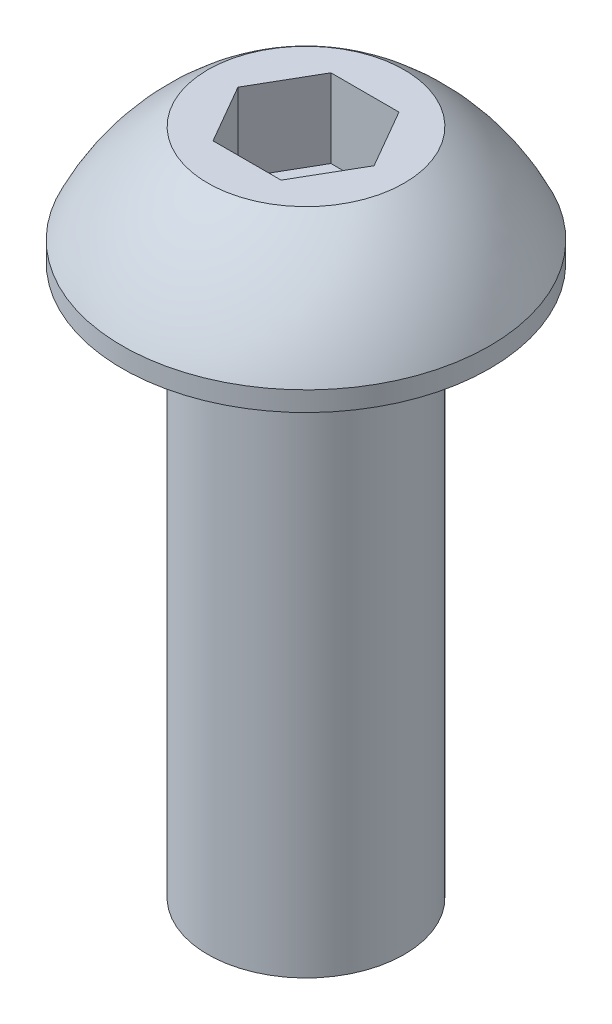
ISO-10303-21;
HEADER;
FILE_DESCRIPTION(('STEP AP214'),'2;1');
FILE_NAME('part.step','',(''),(''),'','','');
FILE_SCHEMA(('AUTOMOTIVE_DESIGN { 1 0 10303 214 1 1 1 1 }'));
ENDSEC;
DATA;
#1=APPLICATION_CONTEXT('core data for automotive mechanical design processes');
#2=APPLICATION_PROTOCOL_DEFINITION('international standard','automotive_design',2000,#1);
#3=PRODUCT_CONTEXT('',#1,'mechanical');
#4=PRODUCT('Part','Part','',(#3));
#5=PRODUCT_RELATED_PRODUCT_CATEGORY('part','',(#4));
#6=PRODUCT_DEFINITION_FORMATION('','',#4);
#7=PRODUCT_DEFINITION_CONTEXT('part definition',#1,'design');
#8=PRODUCT_DEFINITION('design','',#6,#7);
#9=PRODUCT_DEFINITION_SHAPE('','',#8);
#10=(LENGTH_UNIT() NAMED_UNIT(*) SI_UNIT(.MILLI.,.METRE.));
#11=(NAMED_UNIT(*) PLANE_ANGLE_UNIT() SI_UNIT($,.RADIAN.));
#12=(NAMED_UNIT(*) SI_UNIT($,.STERADIAN.) SOLID_ANGLE_UNIT());
#13=UNCERTAINTY_MEASURE_WITH_UNIT(LENGTH_MEASURE(1.E-05),#10,'distance_accuracy_value','');
#14=(GEOMETRIC_REPRESENTATION_CONTEXT(3) GLOBAL_UNCERTAINTY_ASSIGNED_CONTEXT((#13)) GLOBAL_UNIT_ASSIGNED_CONTEXT((#10,
#11,#12)) REPRESENTATION_CONTEXT('',''));
#15=CARTESIAN_POINT('',(0.,0.,0.));
#16=DIRECTION('',(0.,0.,1.));
#17=DIRECTION('',(1.,0.,0.));
#18=AXIS2_PLACEMENT_3D('',#15,#16,#17);
#19=CARTESIAN_POINT('',(0.,-14.,0.));
#20=DIRECTION('',(0.,-1.,0.));
#21=DIRECTION('',(1.,0.,0.));
#22=AXIS2_PLACEMENT_3D('',#19,#20,#21);
#23=CYLINDRICAL_SURFACE('',#22,2.5);
#24=CARTESIAN_POINT('',(0.,0.,0.));
#25=DIRECTION('',(0.,-1.,0.));
#26=DIRECTION('',(1.,0.,0.));
#27=AXIS2_PLACEMENT_3D('',#24,#25,#26);
#28=CIRCLE('',#27,2.5);
#29=CARTESIAN_POINT('',(2.5,0.,0.));
#30=VERTEX_POINT('',#29);
#31=EDGE_CURVE('E11',#30,#30,#28,.T.);
#32=ORIENTED_EDGE('',*,*,#31,.T.);
#33=EDGE_LOOP('',(#32));
#34=FACE_BOUND('',#33,.T.);
#35=CARTESIAN_POINT('',(0.,-14.,0.));
#36=DIRECTION('',(0.,-1.,0.));
#37=DIRECTION('',(1.,0.,0.));
#38=AXIS2_PLACEMENT_3D('',#35,#36,#37);
#39=CIRCLE('',#38,2.5);
#40=CARTESIAN_POINT('',(2.5,-14.,0.));
#41=VERTEX_POINT('',#40);
#42=EDGE_CURVE('E168',#41,#41,#39,.T.);
#43=ORIENTED_EDGE('',*,*,#42,.F.);
#44=EDGE_LOOP('',(#43));
#45=FACE_BOUND('',#44,.T.);
#46=ADVANCED_FACE('F41',(#34,#45),#23,.T.);
#47=CARTESIAN_POINT('',(2.5,0.,0.));
#48=DIRECTION('',(0.,-1.,0.));
#49=DIRECTION('',(1.,0.,0.));
#50=AXIS2_PLACEMENT_3D('',#47,#48,#49);
#51=PLANE('',#50);
#52=CARTESIAN_POINT('',(0.,0.,0.));
#53=DIRECTION('',(0.,-1.,0.));
#54=DIRECTION('',(1.,0.,0.));
#55=AXIS2_PLACEMENT_3D('',#52,#53,#54);
#56=CIRCLE('',#55,4.675);
#57=CARTESIAN_POINT('',(4.675,0.,0.));
#58=VERTEX_POINT('',#57);
#59=EDGE_CURVE('E49',#58,#58,#56,.T.);
#60=ORIENTED_EDGE('',*,*,#59,.T.);
#61=EDGE_LOOP('',(#60));
#62=FACE_BOUND('',#61,.T.);
#63=ORIENTED_EDGE('',*,*,#31,.F.);
#64=EDGE_LOOP('',(#63));
#65=FACE_BOUND('',#64,.T.);
#66=ADVANCED_FACE('F190',(#62,#65),#51,.T.);
#67=CARTESIAN_POINT('',(0.,-14.,0.));
#68=DIRECTION('',(0.,-1.,0.));
#69=DIRECTION('',(1.,0.,0.));
#70=AXIS2_PLACEMENT_3D('',#67,#68,#69);
#71=CYLINDRICAL_SURFACE('',#70,4.675);
#72=CARTESIAN_POINT('',(0.,0.5,0.));
#73=DIRECTION('',(0.,-1.,0.));
#74=DIRECTION('',(1.,0.,0.));
#75=AXIS2_PLACEMENT_3D('',#72,#73,#74);
#76=CIRCLE('',#75,4.675);
#77=CARTESIAN_POINT('',(4.675,0.5,0.));
#78=VERTEX_POINT('',#77);
#79=EDGE_CURVE('E183',#78,#78,#76,.T.);
#80=ORIENTED_EDGE('',*,*,#79,.T.);
#81=EDGE_LOOP('',(#80));
#82=FACE_BOUND('',#81,.T.);
#83=ORIENTED_EDGE('',*,*,#59,.F.);
#84=EDGE_LOOP('',(#83));
#85=FACE_BOUND('',#84,.T.);
#86=ADVANCED_FACE('F193',(#82,#85),#71,.T.);
#87=CARTESIAN_POINT('',(0.,-2.03506364975577,0.));
#88=DIRECTION('',(0.,-1.,0.));
#89=DIRECTION('',(1.,0.,0.));
#90=AXIS2_PLACEMENT_3D('',#87,#88,#89);
#91=DEGENERATE_TOROIDAL_SURFACE('',#90,0.763147873282498,6.,.F.);
#92=CARTESIAN_POINT('',(0.,3.,0.));
#93=DIRECTION('',(0.,-1.,0.));
#94=DIRECTION('',(1.,0.,0.));
#95=AXIS2_PLACEMENT_3D('',#92,#93,#94);
#96=CIRCLE('',#95,2.5);
#97=CARTESIAN_POINT('',(2.5,3.,0.));
#98=VERTEX_POINT('',#97);
#99=EDGE_CURVE('E179',#98,#98,#96,.T.);
#100=ORIENTED_EDGE('',*,*,#99,.T.);
#101=EDGE_LOOP('',(#100));
#102=FACE_BOUND('',#101,.T.);
#103=ORIENTED_EDGE('',*,*,#79,.F.);
#104=EDGE_LOOP('',(#103));
#105=FACE_BOUND('',#104,.T.);
#106=ADVANCED_FACE('F195',(#102,#105),#91,.F.);
#107=CARTESIAN_POINT('',(2.5,3.,0.));
#108=DIRECTION('',(0.,1.,0.));
#109=DIRECTION('',(-1.,0.,0.));
#110=AXIS2_PLACEMENT_3D('',#107,#108,#109);
#111=PLANE('',#110);
#112=DIRECTION('',(-0.5,0.,-0.866025403784439));
#113=VECTOR('',#112,1.);
#114=CARTESIAN_POINT('',(1.73205080756888,3.,0.));
#115=LINE('',#114,#113);
#116=CARTESIAN_POINT('',(1.73205080756888,3.,0.));
#117=VERTEX_POINT('',#116);
#118=CARTESIAN_POINT('',(0.866025403784438,3.,-1.5));
#119=VERTEX_POINT('',#118);
#120=EDGE_CURVE('E58',#117,#119,#115,.T.);
#121=ORIENTED_EDGE('',*,*,#120,.F.);
#122=DIRECTION('',(0.5,0.,-0.866025403784439));
#123=VECTOR('',#122,1.);
#124=CARTESIAN_POINT('',(0.866025403784439,3.,1.5));
#125=LINE('',#124,#123);
#126=CARTESIAN_POINT('',(0.866025403784439,3.,1.5));
#127=VERTEX_POINT('',#126);
#128=EDGE_CURVE('E162',#127,#117,#125,.T.);
#129=ORIENTED_EDGE('',*,*,#128,.F.);
#130=DIRECTION('',(1.,0.,0.));
#131=VECTOR('',#130,1.);
#132=CARTESIAN_POINT('',(-0.866025403784437,3.,1.5));
#133=LINE('',#132,#131);
#134=CARTESIAN_POINT('',(-0.866025403784437,3.,1.5));
#135=VERTEX_POINT('',#134);
#136=EDGE_CURVE('E159',#135,#127,#133,.T.);
#137=ORIENTED_EDGE('',*,*,#136,.F.);
#138=DIRECTION('',(0.5,0.,0.866025403784438));
#139=VECTOR('',#138,1.);
#140=CARTESIAN_POINT('',(-1.73205080756888,3.,0.));
#141=LINE('',#140,#139);
#142=CARTESIAN_POINT('',(-1.73205080756888,3.,0.));
#143=VERTEX_POINT('',#142);
#144=EDGE_CURVE('E116',#143,#135,#141,.T.);
#145=ORIENTED_EDGE('',*,*,#144,.F.);
#146=DIRECTION('',(-0.5,0.,0.866025403784439));
#147=VECTOR('',#146,1.);
#148=CARTESIAN_POINT('',(-0.866025403784438,3.,-1.5));
#149=LINE('',#148,#147);
#150=CARTESIAN_POINT('',(-0.866025403784438,3.,-1.5));
#151=VERTEX_POINT('',#150);
#152=EDGE_CURVE('E153',#151,#143,#149,.T.);
#153=ORIENTED_EDGE('',*,*,#152,.F.);
#154=DIRECTION('',(-1.,0.,0.));
#155=VECTOR('',#154,1.);
#156=CARTESIAN_POINT('',(0.866025403784438,3.,-1.5));
#157=LINE('',#156,#155);
#158=EDGE_CURVE('E149',#119,#151,#157,.T.);
#159=ORIENTED_EDGE('',*,*,#158,.F.);
#160=EDGE_LOOP('',(#121,#129,#137,#145,#153,#159));
#161=FACE_BOUND('',#160,.T.);
#162=ORIENTED_EDGE('',*,*,#99,.F.);
#163=EDGE_LOOP('',(#162));
#164=FACE_BOUND('',#163,.T.);
#165=ADVANCED_FACE('F202',(#161,#164),#111,.T.);
#166=CARTESIAN_POINT('',(2.5,-14.,0.));
#167=DIRECTION('',(0.,-1.,0.));
#168=DIRECTION('',(1.,0.,0.));
#169=AXIS2_PLACEMENT_3D('',#166,#167,#168);
#170=PLANE('',#169);
#171=ORIENTED_EDGE('',*,*,#42,.T.);
#172=EDGE_LOOP('',(#171));
#173=FACE_BOUND('',#172,.T.);
#174=ADVANCED_FACE('F213',(#173),#170,.T.);
#175=CARTESIAN_POINT('',(1.73205080756888,0.999999999999999,0.));
#176=DIRECTION('',(0.866025403784439,0.,-0.5));
#177=DIRECTION('',(-0.5,0.,-0.866025403784439));
#178=AXIS2_PLACEMENT_3D('',#175,#176,#177);
#179=PLANE('',#178);
#180=ORIENTED_EDGE('',*,*,#120,.T.);
#181=DIRECTION('',(0.,1.,0.));
#182=VECTOR('',#181,1.);
#183=CARTESIAN_POINT('',(0.866025403784438,0.999999999999999,-1.5));
#184=LINE('',#183,#182);
#185=CARTESIAN_POINT('',(0.866025403784438,0.999999999999999,-1.5));
#186=VERTEX_POINT('',#185);
#187=EDGE_CURVE('E95',#186,#119,#184,.T.);
#188=ORIENTED_EDGE('',*,*,#187,.F.);
#189=DIRECTION('',(-0.5,0.,-0.866025403784439));
#190=VECTOR('',#189,1.);
#191=CARTESIAN_POINT('',(1.73205080756888,0.999999999999999,0.));
#192=LINE('',#191,#190);
#193=CARTESIAN_POINT('',(1.73205080756888,0.999999999999999,0.));
#194=VERTEX_POINT('',#193);
#195=EDGE_CURVE('E165',#194,#186,#192,.T.);
#196=ORIENTED_EDGE('',*,*,#195,.F.);
#197=DIRECTION('',(0.,1.,0.));
#198=VECTOR('',#197,1.);
#199=CARTESIAN_POINT('',(1.73205080756888,0.999999999999999,0.));
#200=LINE('',#199,#198);
#201=EDGE_CURVE('E69',#194,#117,#200,.T.);
#202=ORIENTED_EDGE('',*,*,#201,.T.);
#203=EDGE_LOOP('',(#180,#188,#196,#202));
#204=FACE_BOUND('',#203,.T.);
#205=ADVANCED_FACE('F215',(#204),#179,.F.);
#206=CARTESIAN_POINT('',(0.866025403784439,0.999999999999999,1.5));
#207=DIRECTION('',(0.866025403784439,0.,0.5));
#208=DIRECTION('',(0.5,0.,-0.866025403784439));
#209=AXIS2_PLACEMENT_3D('',#206,#207,#208);
#210=PLANE('',#209);
#211=ORIENTED_EDGE('',*,*,#128,.T.);
#212=ORIENTED_EDGE('',*,*,#201,.F.);
#213=DIRECTION('',(0.5,0.,-0.866025403784439));
#214=VECTOR('',#213,1.);
#215=CARTESIAN_POINT('',(0.866025403784439,0.999999999999999,1.5));
#216=LINE('',#215,#214);
#217=CARTESIAN_POINT('',(0.866025403784439,0.999999999999999,1.5));
#218=VERTEX_POINT('',#217);
#219=EDGE_CURVE('E130',#218,#194,#216,.T.);
#220=ORIENTED_EDGE('',*,*,#219,.F.);
#221=DIRECTION('',(0.,1.,0.));
#222=VECTOR('',#221,1.);
#223=CARTESIAN_POINT('',(0.866025403784439,0.999999999999999,1.5));
#224=LINE('',#223,#222);
#225=EDGE_CURVE('E121',#218,#127,#224,.T.);
#226=ORIENTED_EDGE('',*,*,#225,.T.);
#227=EDGE_LOOP('',(#211,#212,#220,#226));
#228=FACE_BOUND('',#227,.T.);
#229=ADVANCED_FACE('F221',(#228),#210,.F.);
#230=CARTESIAN_POINT('',(-0.866025403784437,0.999999999999999,1.5));
#231=DIRECTION('',(0.,0.,1.));
#232=DIRECTION('',(1.,0.,0.));
#233=AXIS2_PLACEMENT_3D('',#230,#231,#232);
#234=PLANE('',#233);
#235=ORIENTED_EDGE('',*,*,#136,.T.);
#236=ORIENTED_EDGE('',*,*,#225,.F.);
#237=DIRECTION('',(1.,0.,0.));
#238=VECTOR('',#237,1.);
#239=CARTESIAN_POINT('',(-0.866025403784437,0.999999999999999,1.5));
#240=LINE('',#239,#238);
#241=CARTESIAN_POINT('',(-0.866025403784437,0.999999999999999,1.5));
#242=VERTEX_POINT('',#241);
#243=EDGE_CURVE('E125',#242,#218,#240,.T.);
#244=ORIENTED_EDGE('',*,*,#243,.F.);
#245=DIRECTION('',(0.,1.,0.));
#246=VECTOR('',#245,1.);
#247=CARTESIAN_POINT('',(-0.866025403784437,0.999999999999999,1.5));
#248=LINE('',#247,#246);
#249=EDGE_CURVE('E109',#242,#135,#248,.T.);
#250=ORIENTED_EDGE('',*,*,#249,.T.);
#251=EDGE_LOOP('',(#235,#236,#244,#250));
#252=FACE_BOUND('',#251,.T.);
#253=ADVANCED_FACE('F126',(#252),#234,.F.);
#254=CARTESIAN_POINT('',(-1.73205080756888,0.999999999999999,0.));
#255=DIRECTION('',(-0.866025403784438,0.,0.5));
#256=DIRECTION('',(0.5,0.,0.866025403784438));
#257=AXIS2_PLACEMENT_3D('',#254,#255,#256);
#258=PLANE('',#257);
#259=ORIENTED_EDGE('',*,*,#144,.T.);
#260=ORIENTED_EDGE('',*,*,#249,.F.);
#261=DIRECTION('',(0.5,0.,0.866025403784438));
#262=VECTOR('',#261,1.);
#263=CARTESIAN_POINT('',(-1.73205080756888,0.999999999999999,0.));
#264=LINE('',#263,#262);
#265=CARTESIAN_POINT('',(-1.73205080756888,0.999999999999999,0.));
#266=VERTEX_POINT('',#265);
#267=EDGE_CURVE('E113',#266,#242,#264,.T.);
#268=ORIENTED_EDGE('',*,*,#267,.F.);
#269=DIRECTION('',(0.,1.,0.));
#270=VECTOR('',#269,1.);
#271=CARTESIAN_POINT('',(-1.73205080756888,0.999999999999999,0.));
#272=LINE('',#271,#270);
#273=EDGE_CURVE('E122',#266,#143,#272,.T.);
#274=ORIENTED_EDGE('',*,*,#273,.T.);
#275=EDGE_LOOP('',(#259,#260,#268,#274));
#276=FACE_BOUND('',#275,.T.);
#277=ADVANCED_FACE('F111',(#276),#258,.F.);
#278=CARTESIAN_POINT('',(-0.866025403784438,0.999999999999999,-1.5));
#279=DIRECTION('',(-0.866025403784439,0.,-0.5));
#280=DIRECTION('',(-0.5,0.,0.866025403784439));
#281=AXIS2_PLACEMENT_3D('',#278,#279,#280);
#282=PLANE('',#281);
#283=ORIENTED_EDGE('',*,*,#152,.T.);
#284=ORIENTED_EDGE('',*,*,#273,.F.);
#285=DIRECTION('',(-0.5,0.,0.866025403784439));
#286=VECTOR('',#285,1.);
#287=CARTESIAN_POINT('',(-0.866025403784438,0.999999999999999,-1.5));
#288=LINE('',#287,#286);
#289=CARTESIAN_POINT('',(-0.866025403784438,0.999999999999999,-1.5));
#290=VERTEX_POINT('',#289);
#291=EDGE_CURVE('E136',#290,#266,#288,.T.);
#292=ORIENTED_EDGE('',*,*,#291,.F.);
#293=DIRECTION('',(0.,1.,0.));
#294=VECTOR('',#293,1.);
#295=CARTESIAN_POINT('',(-0.866025403784438,0.999999999999999,-1.5));
#296=LINE('',#295,#294);
#297=EDGE_CURVE('E172',#290,#151,#296,.T.);
#298=ORIENTED_EDGE('',*,*,#297,.T.);
#299=EDGE_LOOP('',(#283,#284,#292,#298));
#300=FACE_BOUND('',#299,.T.);
#301=ADVANCED_FACE('F229',(#300),#282,.F.);
#302=CARTESIAN_POINT('',(0.866025403784438,0.999999999999999,-1.5));
#303=DIRECTION('',(0.,0.,-1.));
#304=DIRECTION('',(-1.,0.,0.));
#305=AXIS2_PLACEMENT_3D('',#302,#303,#304);
#306=PLANE('',#305);
#307=ORIENTED_EDGE('',*,*,#158,.T.);
#308=ORIENTED_EDGE('',*,*,#297,.F.);
#309=DIRECTION('',(-1.,0.,0.));
#310=VECTOR('',#309,1.);
#311=CARTESIAN_POINT('',(0.866025403784438,0.999999999999999,-1.5));
#312=LINE('',#311,#310);
#313=EDGE_CURVE('E141',#186,#290,#312,.T.);
#314=ORIENTED_EDGE('',*,*,#313,.F.);
#315=ORIENTED_EDGE('',*,*,#187,.T.);
#316=EDGE_LOOP('',(#307,#308,#314,#315));
#317=FACE_BOUND('',#316,.T.);
#318=ADVANCED_FACE('F226',(#317),#306,.F.);
#319=CARTESIAN_POINT('',(0.,0.999999999999999,0.));
#320=DIRECTION('',(0.,1.,0.));
#321=DIRECTION('',(0.,0.,1.));
#322=AXIS2_PLACEMENT_3D('',#319,#320,#321);
#323=PLANE('',#322);
#324=ORIENTED_EDGE('',*,*,#195,.T.);
#325=ORIENTED_EDGE('',*,*,#313,.T.);
#326=ORIENTED_EDGE('',*,*,#291,.T.);
#327=ORIENTED_EDGE('',*,*,#267,.T.);
#328=ORIENTED_EDGE('',*,*,#243,.T.);
#329=ORIENTED_EDGE('',*,*,#219,.T.);
#330=EDGE_LOOP('',(#324,#325,#326,#327,#328,#329));
#331=FACE_BOUND('',#330,.T.);
#332=ADVANCED_FACE('F133',(#331),#323,.T.);
#333=CLOSED_SHELL('',(#46,#66,#86,#106,#165,#174,#205,#229,#253,#277,#301,#318,#332));
#334=MANIFOLD_SOLID_BREP('B2',#333);
#335=ADVANCED_BREP_SHAPE_REPRESENTATION('',(#18,#334),#14);
#336=SHAPE_DEFINITION_REPRESENTATION(#9,#335);
ENDSEC;
END-ISO-10303-21;
